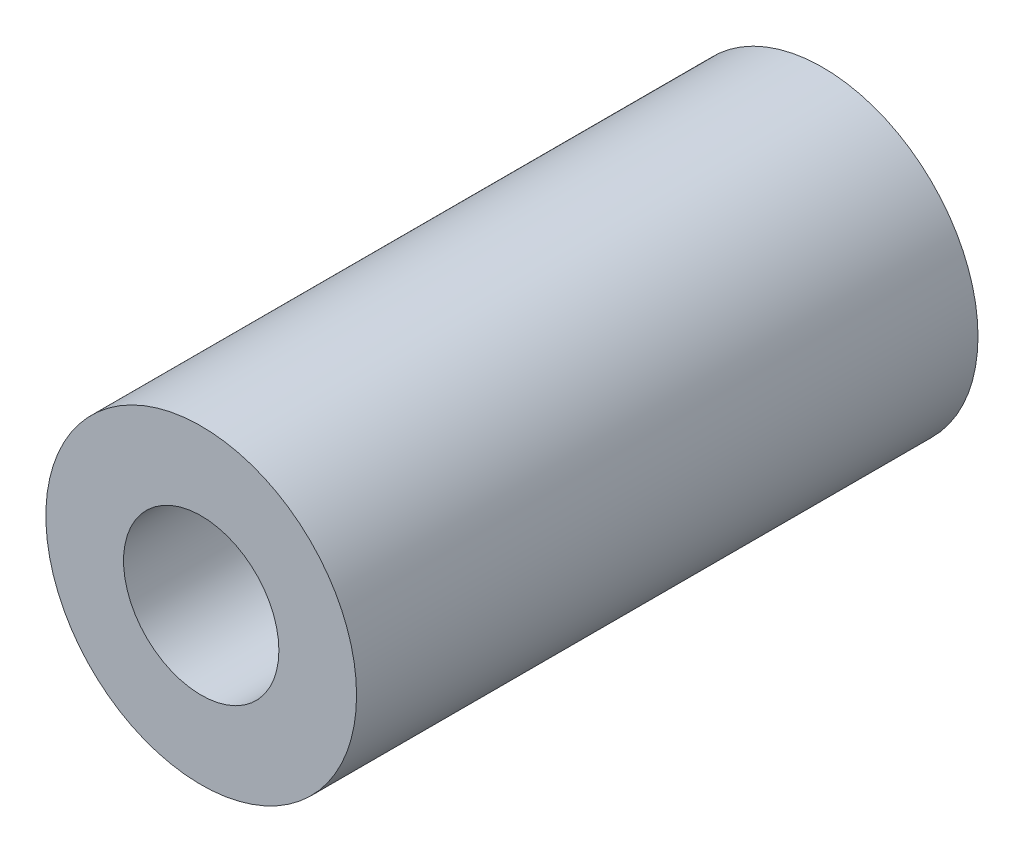
ISO-10303-21;
HEADER;
FILE_DESCRIPTION(('STEP AP214'),'2;1');
FILE_NAME('part.step','',(''),(''),'','','');
FILE_SCHEMA(('AUTOMOTIVE_DESIGN { 1 0 10303 214 1 1 1 1 }'));
ENDSEC;
DATA;
#1=APPLICATION_CONTEXT('core data for automotive mechanical design processes');
#2=APPLICATION_PROTOCOL_DEFINITION('international standard','automotive_design',2000,#1);
#3=PRODUCT_CONTEXT('',#1,'mechanical');
#4=PRODUCT('Part','Part','',(#3));
#5=PRODUCT_RELATED_PRODUCT_CATEGORY('part','',(#4));
#6=PRODUCT_DEFINITION_FORMATION('','',#4);
#7=PRODUCT_DEFINITION_CONTEXT('part definition',#1,'design');
#8=PRODUCT_DEFINITION('design','',#6,#7);
#9=PRODUCT_DEFINITION_SHAPE('','',#8);
#10=(LENGTH_UNIT() NAMED_UNIT(*) SI_UNIT(.MILLI.,.METRE.));
#11=(NAMED_UNIT(*) PLANE_ANGLE_UNIT() SI_UNIT($,.RADIAN.));
#12=(NAMED_UNIT(*) SI_UNIT($,.STERADIAN.) SOLID_ANGLE_UNIT());
#13=UNCERTAINTY_MEASURE_WITH_UNIT(LENGTH_MEASURE(1.E-05),#10,'distance_accuracy_value','');
#14=(GEOMETRIC_REPRESENTATION_CONTEXT(3) GLOBAL_UNCERTAINTY_ASSIGNED_CONTEXT((#13)) GLOBAL_UNIT_ASSIGNED_CONTEXT((#10,
#11,#12)) REPRESENTATION_CONTEXT('',''));
#15=CARTESIAN_POINT('',(0.,0.,0.));
#16=DIRECTION('',(0.,0.,1.));
#17=DIRECTION('',(1.,0.,0.));
#18=AXIS2_PLACEMENT_3D('',#15,#16,#17);
#19=CARTESIAN_POINT('',(0.,0.,12.));
#20=DIRECTION('',(0.,0.,1.));
#21=DIRECTION('',(1.,0.,0.));
#22=AXIS2_PLACEMENT_3D('',#19,#20,#21);
#23=PLANE('',#22);
#24=CARTESIAN_POINT('',(0.,0.,12.));
#25=DIRECTION('',(0.,0.,1.));
#26=DIRECTION('',(1.,0.,0.));
#27=AXIS2_PLACEMENT_3D('',#24,#25,#26);
#28=CIRCLE('',#27,3.);
#29=CARTESIAN_POINT('',(3.,0.,12.));
#30=VERTEX_POINT('',#29);
#31=EDGE_CURVE('E10',#30,#30,#28,.T.);
#32=ORIENTED_EDGE('',*,*,#31,.T.);
#33=EDGE_LOOP('',(#32));
#34=FACE_BOUND('',#33,.T.);
#35=CARTESIAN_POINT('',(0.,0.,12.));
#36=DIRECTION('',(0.,0.,1.));
#37=DIRECTION('',(1.,0.,0.));
#38=AXIS2_PLACEMENT_3D('',#35,#36,#37);
#39=CIRCLE('',#38,1.5);
#40=CARTESIAN_POINT('',(1.5,0.,12.));
#41=VERTEX_POINT('',#40);
#42=EDGE_CURVE('E50',#41,#41,#39,.T.);
#43=ORIENTED_EDGE('',*,*,#42,.F.);
#44=EDGE_LOOP('',(#43));
#45=FACE_BOUND('',#44,.T.);
#46=ADVANCED_FACE('F37',(#34,#45),#23,.T.);
#47=CARTESIAN_POINT('',(0.,0.,0.));
#48=DIRECTION('',(0.,0.,1.));
#49=DIRECTION('',(1.,0.,0.));
#50=AXIS2_PLACEMENT_3D('',#47,#48,#49);
#51=PLANE('',#50);
#52=CARTESIAN_POINT('',(0.,0.,0.));
#53=DIRECTION('',(0.,0.,1.));
#54=DIRECTION('',(1.,0.,0.));
#55=AXIS2_PLACEMENT_3D('',#52,#53,#54);
#56=CIRCLE('',#55,3.);
#57=CARTESIAN_POINT('',(3.,0.,0.));
#58=VERTEX_POINT('',#57);
#59=EDGE_CURVE('E41',#58,#58,#56,.T.);
#60=ORIENTED_EDGE('',*,*,#59,.F.);
#61=EDGE_LOOP('',(#60));
#62=FACE_BOUND('',#61,.T.);
#63=CARTESIAN_POINT('',(0.,0.,0.));
#64=DIRECTION('',(0.,0.,1.));
#65=DIRECTION('',(1.,0.,0.));
#66=AXIS2_PLACEMENT_3D('',#63,#64,#65);
#67=CIRCLE('',#66,1.5);
#68=CARTESIAN_POINT('',(1.5,0.,0.));
#69=VERTEX_POINT('',#68);
#70=EDGE_CURVE('E52',#69,#69,#67,.T.);
#71=ORIENTED_EDGE('',*,*,#70,.T.);
#72=EDGE_LOOP('',(#71));
#73=FACE_BOUND('',#72,.T.);
#74=ADVANCED_FACE('F64',(#62,#73),#51,.F.);
#75=CARTESIAN_POINT('',(0.,0.,12.));
#76=DIRECTION('',(0.,0.,-1.));
#77=DIRECTION('',(-1.,0.,0.));
#78=AXIS2_PLACEMENT_3D('',#75,#76,#77);
#79=CYLINDRICAL_SURFACE('',#78,3.);
#80=ORIENTED_EDGE('',*,*,#31,.F.);
#81=EDGE_LOOP('',(#80));
#82=FACE_BOUND('',#81,.T.);
#83=ORIENTED_EDGE('',*,*,#59,.T.);
#84=EDGE_LOOP('',(#83));
#85=FACE_BOUND('',#84,.T.);
#86=ADVANCED_FACE('F39',(#82,#85),#79,.T.);
#87=CARTESIAN_POINT('',(0.,0.,12.));
#88=DIRECTION('',(0.,0.,-1.));
#89=DIRECTION('',(-1.,0.,0.));
#90=AXIS2_PLACEMENT_3D('',#87,#88,#89);
#91=CYLINDRICAL_SURFACE('',#90,1.5);
#92=ORIENTED_EDGE('',*,*,#42,.T.);
#93=EDGE_LOOP('',(#92));
#94=FACE_BOUND('',#93,.T.);
#95=ORIENTED_EDGE('',*,*,#70,.F.);
#96=EDGE_LOOP('',(#95));
#97=FACE_BOUND('',#96,.T.);
#98=ADVANCED_FACE('F60',(#94,#97),#91,.F.);
#99=CLOSED_SHELL('',(#46,#74,#86,#98));
#100=MANIFOLD_SOLID_BREP('B2',#99);
#101=ADVANCED_BREP_SHAPE_REPRESENTATION('',(#18,#100),#14);
#102=SHAPE_DEFINITION_REPRESENTATION(#9,#101);
ENDSEC;
END-ISO-10303-21;
